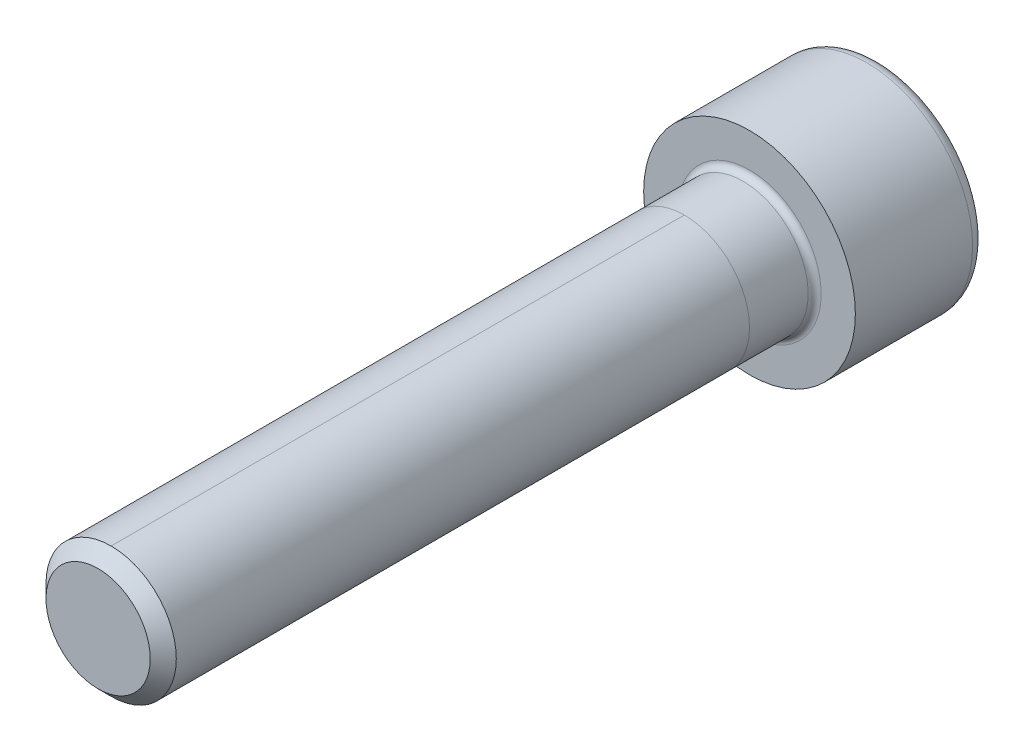
ISO-10303-21;
HEADER;
FILE_DESCRIPTION(('STEP AP214'),'2;1');
FILE_NAME('part.step','',(''),(''),'','','');
FILE_SCHEMA(('AUTOMOTIVE_DESIGN { 1 0 10303 214 1 1 1 1 }'));
ENDSEC;
DATA;
#1=APPLICATION_CONTEXT('core data for automotive mechanical design processes');
#2=APPLICATION_PROTOCOL_DEFINITION('international standard','automotive_design',2000,#1);
#3=PRODUCT_CONTEXT('',#1,'mechanical');
#4=PRODUCT('Part','Part','',(#3));
#5=PRODUCT_RELATED_PRODUCT_CATEGORY('part','',(#4));
#6=PRODUCT_DEFINITION_FORMATION('','',#4);
#7=PRODUCT_DEFINITION_CONTEXT('part definition',#1,'design');
#8=PRODUCT_DEFINITION('design','',#6,#7);
#9=PRODUCT_DEFINITION_SHAPE('','',#8);
#10=(LENGTH_UNIT() NAMED_UNIT(*) SI_UNIT(.MILLI.,.METRE.));
#11=(NAMED_UNIT(*) PLANE_ANGLE_UNIT() SI_UNIT($,.RADIAN.));
#12=(NAMED_UNIT(*) SI_UNIT($,.STERADIAN.) SOLID_ANGLE_UNIT());
#13=UNCERTAINTY_MEASURE_WITH_UNIT(LENGTH_MEASURE(1.E-05),#10,'distance_accuracy_value','');
#14=(GEOMETRIC_REPRESENTATION_CONTEXT(3) GLOBAL_UNCERTAINTY_ASSIGNED_CONTEXT((#13)) GLOBAL_UNIT_ASSIGNED_CONTEXT((#10,
#11,#12)) REPRESENTATION_CONTEXT('',''));
#15=CARTESIAN_POINT('',(0.,0.,0.));
#16=DIRECTION('',(0.,0.,1.));
#17=DIRECTION('',(1.,0.,0.));
#18=AXIS2_PLACEMENT_3D('',#15,#16,#17);
#19=CARTESIAN_POINT('',(0.,0.,40.));
#20=DIRECTION('',(0.,0.,-1.));
#21=DIRECTION('',(-1.,0.,0.));
#22=AXIS2_PLACEMENT_3D('',#19,#20,#21);
#23=CYLINDRICAL_SURFACE('',#22,4.);
#24=DIRECTION('',(0.,0.,-1.));
#25=VECTOR('',#24,1.);
#26=CARTESIAN_POINT('',(0.,4.,40.));
#27=LINE('',#26,#25);
#28=CARTESIAN_POINT('',(0.,4.,39.2));
#29=VERTEX_POINT('',#28);
#30=CARTESIAN_POINT('',(0.,4.,3.99999999999999));
#31=VERTEX_POINT('',#30);
#32=EDGE_CURVE('E58',#29,#31,#27,.T.);
#33=ORIENTED_EDGE('',*,*,#32,.F.);
#34=CARTESIAN_POINT('',(0.,0.,39.2));
#35=DIRECTION('',(0.,0.,1.));
#36=DIRECTION('',(1.,0.,0.));
#37=AXIS2_PLACEMENT_3D('',#34,#35,#36);
#38=CIRCLE('',#37,4.);
#39=CARTESIAN_POINT('',(0.,-4.,39.2));
#40=VERTEX_POINT('',#39);
#41=EDGE_CURVE('E192',#29,#40,#38,.F.);
#42=ORIENTED_EDGE('',*,*,#41,.T.);
#43=DIRECTION('',(0.,0.,-1.));
#44=VECTOR('',#43,1.);
#45=CARTESIAN_POINT('',(0.,-4.,40.));
#46=LINE('',#45,#44);
#47=CARTESIAN_POINT('',(0.,-4.,4.00000000000001));
#48=VERTEX_POINT('',#47);
#49=EDGE_CURVE('E195',#40,#48,#46,.T.);
#50=ORIENTED_EDGE('',*,*,#49,.T.);
#51=CARTESIAN_POINT('',(0.,0.,4.));
#52=DIRECTION('',(0.,0.,1.));
#53=DIRECTION('',(0.,-1.,0.));
#54=AXIS2_PLACEMENT_3D('',#51,#52,#53);
#55=CIRCLE('',#54,4.);
#56=EDGE_CURVE('E64',#48,#31,#55,.T.);
#57=ORIENTED_EDGE('',*,*,#56,.T.);
#58=EDGE_LOOP('',(#33,#42,#50,#57));
#59=FACE_BOUND('',#58,.T.);
#60=ADVANCED_FACE('F43',(#59),#23,.T.);
#61=CARTESIAN_POINT('',(0.,0.,0.399999999999998));
#62=DIRECTION('',(0.,0.,-1.));
#63=DIRECTION('',(-1.,0.,0.));
#64=AXIS2_PLACEMENT_3D('',#61,#62,#63);
#65=CIRCLE('',#64,4.);
#66=CARTESIAN_POINT('',(-4.,0.,0.399999999999998));
#67=VERTEX_POINT('',#66);
#68=EDGE_CURVE('E12',#67,#67,#65,.F.);
#69=ORIENTED_EDGE('',*,*,#68,.T.);
#70=EDGE_LOOP('',(#69));
#71=FACE_BOUND('',#70,.T.);
#72=ORIENTED_EDGE('',*,*,#56,.F.);
#73=EDGE_CURVE('E217',#31,#48,#55,.T.);
#74=ORIENTED_EDGE('',*,*,#73,.F.);
#75=EDGE_LOOP('',(#72,#74));
#76=FACE_BOUND('',#75,.T.);
#77=ADVANCED_FACE('F235',(#71,#76),#23,.T.);
#78=EDGE_CURVE('E193',#40,#29,#38,.F.);
#79=ORIENTED_EDGE('',*,*,#78,.T.);
#80=ORIENTED_EDGE('',*,*,#32,.T.);
#81=ORIENTED_EDGE('',*,*,#73,.T.);
#82=ORIENTED_EDGE('',*,*,#49,.F.);
#83=EDGE_LOOP('',(#79,#80,#81,#82));
#84=FACE_BOUND('',#83,.T.);
#85=ADVANCED_FACE('F238',(#84),#23,.T.);
#86=CARTESIAN_POINT('',(0.,0.,40.));
#87=DIRECTION('',(0.,0.,1.));
#88=DIRECTION('',(1.,0.,0.));
#89=AXIS2_PLACEMENT_3D('',#86,#87,#88);
#90=PLANE('',#89);
#91=CARTESIAN_POINT('',(0.,0.,40.));
#92=DIRECTION('',(0.,0.,1.));
#93=DIRECTION('',(1.,0.,0.));
#94=AXIS2_PLACEMENT_3D('',#91,#92,#93);
#95=CIRCLE('',#94,3.20000000000001);
#96=CARTESIAN_POINT('',(3.20000000000001,0.,40.));
#97=VERTEX_POINT('',#96);
#98=EDGE_CURVE('E189',#97,#97,#95,.T.);
#99=ORIENTED_EDGE('',*,*,#98,.T.);
#100=EDGE_LOOP('',(#99));
#101=FACE_BOUND('',#100,.T.);
#102=ADVANCED_FACE('F246',(#101),#90,.T.);
#103=CARTESIAN_POINT('',(0.,0.,0.));
#104=DIRECTION('',(0.,0.,-1.));
#105=DIRECTION('',(-1.,0.,0.));
#106=AXIS2_PLACEMENT_3D('',#103,#104,#105);
#107=PLANE('',#106);
#108=CARTESIAN_POINT('',(0.,0.,0.));
#109=DIRECTION('',(0.,0.,-1.));
#110=DIRECTION('',(-1.,0.,0.));
#111=AXIS2_PLACEMENT_3D('',#108,#109,#110);
#112=CIRCLE('',#111,4.4);
#113=CARTESIAN_POINT('',(-4.4,0.,0.));
#114=VERTEX_POINT('',#113);
#115=EDGE_CURVE('E51',#114,#114,#112,.T.);
#116=ORIENTED_EDGE('',*,*,#115,.T.);
#117=EDGE_LOOP('',(#116));
#118=FACE_BOUND('',#117,.T.);
#119=CARTESIAN_POINT('',(0.,0.,0.));
#120=DIRECTION('',(0.,0.,-1.));
#121=DIRECTION('',(-1.,0.,0.));
#122=AXIS2_PLACEMENT_3D('',#119,#120,#121);
#123=CIRCLE('',#122,6.5);
#124=CARTESIAN_POINT('',(-6.5,0.,0.));
#125=VERTEX_POINT('',#124);
#126=EDGE_CURVE('E179',#125,#125,#123,.T.);
#127=ORIENTED_EDGE('',*,*,#126,.F.);
#128=EDGE_LOOP('',(#127));
#129=FACE_BOUND('',#128,.T.);
#130=ADVANCED_FACE('F224',(#118,#129),#107,.F.);
#131=CARTESIAN_POINT('',(0.,0.,-8.));
#132=DIRECTION('',(0.,0.,1.));
#133=DIRECTION('',(1.,0.,0.));
#134=AXIS2_PLACEMENT_3D('',#131,#132,#133);
#135=CYLINDRICAL_SURFACE('',#134,6.5);
#136=CARTESIAN_POINT('',(0.,0.,-7.2));
#137=DIRECTION('',(0.,0.,-1.));
#138=DIRECTION('',(-1.,0.,0.));
#139=AXIS2_PLACEMENT_3D('',#136,#137,#138);
#140=CIRCLE('',#139,6.5);
#141=CARTESIAN_POINT('',(-6.5,0.,-7.2));
#142=VERTEX_POINT('',#141);
#143=EDGE_CURVE('E186',#142,#142,#140,.F.);
#144=ORIENTED_EDGE('',*,*,#143,.T.);
#145=EDGE_LOOP('',(#144));
#146=FACE_BOUND('',#145,.T.);
#147=ORIENTED_EDGE('',*,*,#126,.T.);
#148=EDGE_LOOP('',(#147));
#149=FACE_BOUND('',#148,.T.);
#150=ADVANCED_FACE('F282',(#146,#149),#135,.T.);
#151=CARTESIAN_POINT('',(0.,0.,-8.));
#152=DIRECTION('',(0.,0.,-1.));
#153=DIRECTION('',(-1.,0.,0.));
#154=AXIS2_PLACEMENT_3D('',#151,#152,#153);
#155=PLANE('',#154);
#156=DIRECTION('',(0.5,-0.866025403784439,0.));
#157=VECTOR('',#156,1.);
#158=CARTESIAN_POINT('',(1.73205080756888,3.,-8.));
#159=LINE('',#158,#157);
#160=CARTESIAN_POINT('',(1.73205080756888,3.,-8.));
#161=VERTEX_POINT('',#160);
#162=CARTESIAN_POINT('',(3.46410161513775,0.,-8.));
#163=VERTEX_POINT('',#162);
#164=EDGE_CURVE('E122',#161,#163,#159,.T.);
#165=ORIENTED_EDGE('',*,*,#164,.F.);
#166=DIRECTION('',(1.,0.,0.));
#167=VECTOR('',#166,1.);
#168=CARTESIAN_POINT('',(-1.73205080756888,3.,-8.));
#169=LINE('',#168,#167);
#170=CARTESIAN_POINT('',(-1.73205080756888,3.,-8.));
#171=VERTEX_POINT('',#170);
#172=EDGE_CURVE('E176',#171,#161,#169,.T.);
#173=ORIENTED_EDGE('',*,*,#172,.F.);
#174=DIRECTION('',(0.5,0.866025403784439,0.));
#175=VECTOR('',#174,1.);
#176=CARTESIAN_POINT('',(-3.46410161513775,0.,-8.));
#177=LINE('',#176,#175);
#178=CARTESIAN_POINT('',(-3.46410161513775,0.,-8.));
#179=VERTEX_POINT('',#178);
#180=EDGE_CURVE('E173',#179,#171,#177,.T.);
#181=ORIENTED_EDGE('',*,*,#180,.F.);
#182=DIRECTION('',(-0.5,0.866025403784439,0.));
#183=VECTOR('',#182,1.);
#184=CARTESIAN_POINT('',(-1.73205080756888,-3.,-8.));
#185=LINE('',#184,#183);
#186=CARTESIAN_POINT('',(-1.73205080756888,-3.,-8.));
#187=VERTEX_POINT('',#186);
#188=EDGE_CURVE('E170',#187,#179,#185,.T.);
#189=ORIENTED_EDGE('',*,*,#188,.F.);
#190=DIRECTION('',(-1.,0.,0.));
#191=VECTOR('',#190,1.);
#192=CARTESIAN_POINT('',(1.73205080756888,-3.,-8.));
#193=LINE('',#192,#191);
#194=CARTESIAN_POINT('',(1.73205080756888,-3.,-8.));
#195=VERTEX_POINT('',#194);
#196=EDGE_CURVE('E167',#195,#187,#193,.T.);
#197=ORIENTED_EDGE('',*,*,#196,.F.);
#198=DIRECTION('',(-0.5,-0.866025403784439,0.));
#199=VECTOR('',#198,1.);
#200=CARTESIAN_POINT('',(3.46410161513775,0.,-8.));
#201=LINE('',#200,#199);
#202=EDGE_CURVE('E164',#163,#195,#201,.T.);
#203=ORIENTED_EDGE('',*,*,#202,.F.);
#204=EDGE_LOOP('',(#165,#173,#181,#189,#197,#203));
#205=FACE_BOUND('',#204,.T.);
#206=CARTESIAN_POINT('',(0.,0.,-8.));
#207=DIRECTION('',(0.,0.,-1.));
#208=DIRECTION('',(-1.,0.,0.));
#209=AXIS2_PLACEMENT_3D('',#206,#207,#208);
#210=CIRCLE('',#209,5.7);
#211=CARTESIAN_POINT('',(-5.7,0.,-8.));
#212=VERTEX_POINT('',#211);
#213=EDGE_CURVE('E182',#212,#212,#210,.T.);
#214=ORIENTED_EDGE('',*,*,#213,.T.);
#215=EDGE_LOOP('',(#214));
#216=FACE_BOUND('',#215,.T.);
#217=ADVANCED_FACE('F277',(#205,#216),#155,.T.);
#218=CARTESIAN_POINT('',(0.,0.,-7.2));
#219=DIRECTION('',(0.,0.,-1.));
#220=DIRECTION('',(-1.,0.,0.));
#221=AXIS2_PLACEMENT_3D('',#218,#219,#220);
#222=TOROIDAL_SURFACE('',#221,5.7,0.8);
#223=ORIENTED_EDGE('',*,*,#143,.F.);
#224=EDGE_LOOP('',(#223));
#225=FACE_BOUND('',#224,.T.);
#226=ORIENTED_EDGE('',*,*,#213,.F.);
#227=EDGE_LOOP('',(#226));
#228=FACE_BOUND('',#227,.T.);
#229=ADVANCED_FACE('F268',(#225,#228),#222,.T.);
#230=CARTESIAN_POINT('',(0.,0.,40.));
#231=DIRECTION('',(0.,0.,-1.));
#232=DIRECTION('',(-1.,0.,0.));
#233=AXIS2_PLACEMENT_3D('',#230,#231,#232);
#234=CONICAL_SURFACE('',#233,3.20000000000001,0.785398163397446);
#235=ORIENTED_EDGE('',*,*,#78,.F.);
#236=ORIENTED_EDGE('',*,*,#41,.F.);
#237=EDGE_LOOP('',(#235,#236));
#238=FACE_BOUND('',#237,.T.);
#239=ORIENTED_EDGE('',*,*,#98,.F.);
#240=EDGE_LOOP('',(#239));
#241=FACE_BOUND('',#240,.T.);
#242=ADVANCED_FACE('F255',(#238,#241),#234,.T.);
#243=CARTESIAN_POINT('',(1.73205080756888,3.,-5.33333333333333));
#244=DIRECTION('',(0.866025403784439,0.5,0.));
#245=DIRECTION('',(-0.5,0.866025403784439,0.));
#246=AXIS2_PLACEMENT_3D('',#243,#244,#245);
#247=PLANE('',#246);
#248=ORIENTED_EDGE('',*,*,#164,.T.);
#249=DIRECTION('',(0.,0.,-1.));
#250=VECTOR('',#249,1.);
#251=CARTESIAN_POINT('',(3.46410161513775,0.,-5.33333333333333));
#252=LINE('',#251,#250);
#253=CARTESIAN_POINT('',(3.46410161513776,0.,-5.33333333333333));
#254=VERTEX_POINT('',#253);
#255=EDGE_CURVE('E200',#254,#163,#252,.T.);
#256=ORIENTED_EDGE('',*,*,#255,.F.);
#257=DIRECTION('',(-0.5,0.866025403784439,0.));
#258=VECTOR('',#257,1.);
#259=CARTESIAN_POINT('',(3.46410161513775,0.,-5.33333333333333));
#260=LINE('',#259,#258);
#261=CARTESIAN_POINT('',(1.73205080756888,3.,-5.33333333333333));
#262=VERTEX_POINT('',#261);
#263=EDGE_CURVE('E117',#262,#254,#260,.F.);
#264=ORIENTED_EDGE('',*,*,#263,.F.);
#265=DIRECTION('',(0.,0.,-1.));
#266=VECTOR('',#265,1.);
#267=CARTESIAN_POINT('',(1.73205080756888,3.,-5.33333333333333));
#268=LINE('',#267,#266);
#269=EDGE_CURVE('E183',#262,#161,#268,.T.);
#270=ORIENTED_EDGE('',*,*,#269,.T.);
#271=EDGE_LOOP('',(#248,#256,#264,#270));
#272=FACE_BOUND('',#271,.T.);
#273=ADVANCED_FACE('F267',(#272),#247,.F.);
#274=CARTESIAN_POINT('',(-1.73205080756888,3.,-5.33333333333333));
#275=DIRECTION('',(0.,1.,0.));
#276=DIRECTION('',(-1.,0.,0.));
#277=AXIS2_PLACEMENT_3D('',#274,#275,#276);
#278=PLANE('',#277);
#279=ORIENTED_EDGE('',*,*,#172,.T.);
#280=ORIENTED_EDGE('',*,*,#269,.F.);
#281=DIRECTION('',(1.,0.,0.));
#282=VECTOR('',#281,1.);
#283=CARTESIAN_POINT('',(0.,3.,-5.33333333333333));
#284=LINE('',#283,#282);
#285=CARTESIAN_POINT('',(-1.73205080756888,3.,-5.33333333333333));
#286=VERTEX_POINT('',#285);
#287=EDGE_CURVE('E131',#286,#262,#284,.T.);
#288=ORIENTED_EDGE('',*,*,#287,.F.);
#289=DIRECTION('',(0.,0.,-1.));
#290=VECTOR('',#289,1.);
#291=CARTESIAN_POINT('',(-1.73205080756888,3.,-5.33333333333333));
#292=LINE('',#291,#290);
#293=EDGE_CURVE('E196',#286,#171,#292,.T.);
#294=ORIENTED_EDGE('',*,*,#293,.T.);
#295=EDGE_LOOP('',(#279,#280,#288,#294));
#296=FACE_BOUND('',#295,.T.);
#297=ADVANCED_FACE('F274',(#296),#278,.F.);
#298=CARTESIAN_POINT('',(-3.46410161513775,0.,-5.33333333333333));
#299=DIRECTION('',(-0.866025403784439,0.5,0.));
#300=DIRECTION('',(-0.5,-0.866025403784439,0.));
#301=AXIS2_PLACEMENT_3D('',#298,#299,#300);
#302=PLANE('',#301);
#303=ORIENTED_EDGE('',*,*,#180,.T.);
#304=ORIENTED_EDGE('',*,*,#293,.F.);
#305=DIRECTION('',(-0.5,-0.866025403784439,0.));
#306=VECTOR('',#305,1.);
#307=CARTESIAN_POINT('',(-1.73205080756888,3.,-5.33333333333333));
#308=LINE('',#307,#306);
#309=CARTESIAN_POINT('',(-3.46410161513775,0.,-5.33333333333333));
#310=VERTEX_POINT('',#309);
#311=EDGE_CURVE('E139',#310,#286,#308,.F.);
#312=ORIENTED_EDGE('',*,*,#311,.F.);
#313=DIRECTION('',(0.,0.,-1.));
#314=VECTOR('',#313,1.);
#315=CARTESIAN_POINT('',(-3.46410161513775,0.,-5.33333333333333));
#316=LINE('',#315,#314);
#317=EDGE_CURVE('E198',#310,#179,#316,.T.);
#318=ORIENTED_EDGE('',*,*,#317,.T.);
#319=EDGE_LOOP('',(#303,#304,#312,#318));
#320=FACE_BOUND('',#319,.T.);
#321=ADVANCED_FACE('F310',(#320),#302,.F.);
#322=CARTESIAN_POINT('',(-1.73205080756888,-3.,-5.33333333333333));
#323=DIRECTION('',(-0.866025403784439,-0.5,0.));
#324=DIRECTION('',(0.5,-0.866025403784439,0.));
#325=AXIS2_PLACEMENT_3D('',#322,#323,#324);
#326=PLANE('',#325);
#327=ORIENTED_EDGE('',*,*,#188,.T.);
#328=ORIENTED_EDGE('',*,*,#317,.F.);
#329=DIRECTION('',(0.5,-0.866025403784439,0.));
#330=VECTOR('',#329,1.);
#331=CARTESIAN_POINT('',(-3.46410161513776,0.,-5.33333333333333));
#332=LINE('',#331,#330);
#333=CARTESIAN_POINT('',(-1.73205080756888,-3.,-5.33333333333333));
#334=VERTEX_POINT('',#333);
#335=EDGE_CURVE('E147',#334,#310,#332,.F.);
#336=ORIENTED_EDGE('',*,*,#335,.F.);
#337=DIRECTION('',(0.,0.,-1.));
#338=VECTOR('',#337,1.);
#339=CARTESIAN_POINT('',(-1.73205080756888,-3.,-5.33333333333333));
#340=LINE('',#339,#338);
#341=EDGE_CURVE('E205',#334,#187,#340,.T.);
#342=ORIENTED_EDGE('',*,*,#341,.T.);
#343=EDGE_LOOP('',(#327,#328,#336,#342));
#344=FACE_BOUND('',#343,.T.);
#345=ADVANCED_FACE('F306',(#344),#326,.F.);
#346=CARTESIAN_POINT('',(1.73205080756888,-3.,-5.33333333333333));
#347=DIRECTION('',(0.,-1.,0.));
#348=DIRECTION('',(1.,0.,0.));
#349=AXIS2_PLACEMENT_3D('',#346,#347,#348);
#350=PLANE('',#349);
#351=ORIENTED_EDGE('',*,*,#196,.T.);
#352=ORIENTED_EDGE('',*,*,#341,.F.);
#353=DIRECTION('',(1.,0.,0.));
#354=VECTOR('',#353,1.);
#355=CARTESIAN_POINT('',(0.,-3.,-5.33333333333333));
#356=LINE('',#355,#354);
#357=CARTESIAN_POINT('',(1.73205080756888,-3.,-5.33333333333333));
#358=VERTEX_POINT('',#357);
#359=EDGE_CURVE('E154',#358,#334,#356,.F.);
#360=ORIENTED_EDGE('',*,*,#359,.F.);
#361=DIRECTION('',(0.,0.,-1.));
#362=VECTOR('',#361,1.);
#363=CARTESIAN_POINT('',(1.73205080756888,-3.,-5.33333333333333));
#364=LINE('',#363,#362);
#365=EDGE_CURVE('E203',#358,#195,#364,.T.);
#366=ORIENTED_EDGE('',*,*,#365,.T.);
#367=EDGE_LOOP('',(#351,#352,#360,#366));
#368=FACE_BOUND('',#367,.T.);
#369=ADVANCED_FACE('F302',(#368),#350,.F.);
#370=CARTESIAN_POINT('',(3.46410161513775,0.,-5.33333333333333));
#371=DIRECTION('',(0.866025403784439,-0.5,0.));
#372=DIRECTION('',(0.5,0.866025403784439,0.));
#373=AXIS2_PLACEMENT_3D('',#370,#371,#372);
#374=PLANE('',#373);
#375=ORIENTED_EDGE('',*,*,#202,.T.);
#376=ORIENTED_EDGE('',*,*,#365,.F.);
#377=DIRECTION('',(0.5,0.866025403784439,0.));
#378=VECTOR('',#377,1.);
#379=CARTESIAN_POINT('',(1.73205080756888,-3.,-5.33333333333333));
#380=LINE('',#379,#378);
#381=EDGE_CURVE('E159',#254,#358,#380,.F.);
#382=ORIENTED_EDGE('',*,*,#381,.F.);
#383=ORIENTED_EDGE('',*,*,#255,.T.);
#384=EDGE_LOOP('',(#375,#376,#382,#383));
#385=FACE_BOUND('',#384,.T.);
#386=ADVANCED_FACE('F299',(#385),#374,.F.);
#387=CARTESIAN_POINT('',(-1.16634372662244,-0.6733888645331,-3.78781236299868));
#388=DIRECTION('',(0.290126882702444,0.167504833827403,0.942214690279141));
#389=DIRECTION('',(0.955717783517744,0.,-0.294284757111084));
#390=AXIS2_PLACEMENT_3D('',#387,#388,#389);
#391=PLANE('',#390);
#392=DIRECTION('',(-0.477858891758872,-0.827675879374923,0.294284757111084));
#393=VECTOR('',#392,1.);
#394=CARTESIAN_POINT('',(1.73205080756888,3.,-5.33333333333333));
#395=LINE('',#394,#393);
#396=CARTESIAN_POINT('',(0.,0.,-4.26666666666667));
#397=VERTEX_POINT('',#396);
#398=EDGE_CURVE('E114',#262,#397,#395,.T.);
#399=ORIENTED_EDGE('',*,*,#398,.F.);
#400=ORIENTED_EDGE('',*,*,#263,.T.);
#401=DIRECTION('',(-0.955717783517745,0.,0.294284757111084));
#402=VECTOR('',#401,1.);
#403=CARTESIAN_POINT('',(3.46410161513775,0.,-5.33333333333333));
#404=LINE('',#403,#402);
#405=EDGE_CURVE('E111',#254,#397,#404,.T.);
#406=ORIENTED_EDGE('',*,*,#405,.T.);
#407=EDGE_LOOP('',(#399,#400,#406));
#408=FACE_BOUND('',#407,.T.);
#409=ADVANCED_FACE('F113',(#408),#391,.F.);
#410=CARTESIAN_POINT('',(-1.16634372662245,0.6733888645331,-3.78781236299869));
#411=DIRECTION('',(0.290126882702444,-0.167504833827403,0.942214690279141));
#412=DIRECTION('',(0.955717783517745,0.,-0.294284757111084));
#413=AXIS2_PLACEMENT_3D('',#410,#411,#412);
#414=PLANE('',#413);
#415=ORIENTED_EDGE('',*,*,#405,.F.);
#416=ORIENTED_EDGE('',*,*,#381,.T.);
#417=DIRECTION('',(-0.477858891758872,0.827675879374923,0.294284757111084));
#418=VECTOR('',#417,1.);
#419=CARTESIAN_POINT('',(1.73205080756888,-3.,-5.33333333333333));
#420=LINE('',#419,#418);
#421=EDGE_CURVE('E152',#358,#397,#420,.T.);
#422=ORIENTED_EDGE('',*,*,#421,.T.);
#423=EDGE_LOOP('',(#415,#416,#422));
#424=FACE_BOUND('',#423,.T.);
#425=ADVANCED_FACE('F157',(#424),#414,.F.);
#426=CARTESIAN_POINT('',(0.,-1.3467777290662,-3.78781236299868));
#427=DIRECTION('',(0.,0.335009667654806,0.942214690279141));
#428=DIRECTION('',(0.,-0.942214690279141,0.335009667654806));
#429=AXIS2_PLACEMENT_3D('',#426,#427,#428);
#430=PLANE('',#429);
#431=DIRECTION('',(0.477858891758872,-0.827675879374923,0.294284757111084));
#432=VECTOR('',#431,1.);
#433=CARTESIAN_POINT('',(-1.73205080756888,3.,-5.33333333333333));
#434=LINE('',#433,#432);
#435=EDGE_CURVE('E128',#286,#397,#434,.T.);
#436=ORIENTED_EDGE('',*,*,#435,.F.);
#437=ORIENTED_EDGE('',*,*,#287,.T.);
#438=ORIENTED_EDGE('',*,*,#398,.T.);
#439=EDGE_LOOP('',(#436,#437,#438));
#440=FACE_BOUND('',#439,.T.);
#441=ADVANCED_FACE('F127',(#440),#430,.F.);
#442=CARTESIAN_POINT('',(1.16634372662245,-0.6733888645331,-3.78781236299868));
#443=DIRECTION('',(-0.290126882702444,0.167504833827403,0.942214690279141));
#444=DIRECTION('',(0.955717783517744,0.,0.294284757111084));
#445=AXIS2_PLACEMENT_3D('',#442,#443,#444);
#446=PLANE('',#445);
#447=DIRECTION('',(0.955717783517745,0.,0.294284757111084));
#448=VECTOR('',#447,1.);
#449=CARTESIAN_POINT('',(-3.46410161513775,0.,-5.33333333333333));
#450=LINE('',#449,#448);
#451=EDGE_CURVE('E136',#310,#397,#450,.T.);
#452=ORIENTED_EDGE('',*,*,#451,.F.);
#453=ORIENTED_EDGE('',*,*,#311,.T.);
#454=ORIENTED_EDGE('',*,*,#435,.T.);
#455=EDGE_LOOP('',(#452,#453,#454));
#456=FACE_BOUND('',#455,.T.);
#457=ADVANCED_FACE('F135',(#456),#446,.F.);
#458=CARTESIAN_POINT('',(1.16634372662245,0.6733888645331,-3.78781236299868));
#459=DIRECTION('',(-0.290126882702444,-0.167504833827403,0.942214690279141));
#460=DIRECTION('',(0.955717783517744,0.,0.294284757111084));
#461=AXIS2_PLACEMENT_3D('',#458,#459,#460);
#462=PLANE('',#461);
#463=DIRECTION('',(0.477858891758872,0.827675879374923,0.294284757111084));
#464=VECTOR('',#463,1.);
#465=CARTESIAN_POINT('',(-1.73205080756888,-3.,-5.33333333333333));
#466=LINE('',#465,#464);
#467=EDGE_CURVE('E144',#334,#397,#466,.T.);
#468=ORIENTED_EDGE('',*,*,#467,.F.);
#469=ORIENTED_EDGE('',*,*,#335,.T.);
#470=ORIENTED_EDGE('',*,*,#451,.T.);
#471=EDGE_LOOP('',(#468,#469,#470));
#472=FACE_BOUND('',#471,.T.);
#473=ADVANCED_FACE('F143',(#472),#462,.F.);
#474=CARTESIAN_POINT('',(0.,1.3467777290662,-3.78781236299868));
#475=DIRECTION('',(0.,-0.335009667654806,0.942214690279141));
#476=DIRECTION('',(0.,-0.942214690279141,-0.335009667654806));
#477=AXIS2_PLACEMENT_3D('',#474,#475,#476);
#478=PLANE('',#477);
#479=ORIENTED_EDGE('',*,*,#421,.F.);
#480=ORIENTED_EDGE('',*,*,#359,.T.);
#481=ORIENTED_EDGE('',*,*,#467,.T.);
#482=EDGE_LOOP('',(#479,#480,#481));
#483=FACE_BOUND('',#482,.T.);
#484=ADVANCED_FACE('F151',(#483),#478,.F.);
#485=CARTESIAN_POINT('',(0.,0.,0.399999999999998));
#486=DIRECTION('',(0.,0.,-1.));
#487=DIRECTION('',(-1.,0.,0.));
#488=AXIS2_PLACEMENT_3D('',#485,#486,#487);
#489=TOROIDAL_SURFACE('',#488,4.4,0.4);
#490=ORIENTED_EDGE('',*,*,#68,.F.);
#491=EDGE_LOOP('',(#490));
#492=FACE_BOUND('',#491,.T.);
#493=ORIENTED_EDGE('',*,*,#115,.F.);
#494=EDGE_LOOP('',(#493));
#495=FACE_BOUND('',#494,.T.);
#496=ADVANCED_FACE('F45',(#492,#495),#489,.F.);
#497=CLOSED_SHELL('',(#60,#77,#85,#102,#130,#150,#217,#229,#242,#273,#297,#321,#345,#369,#386,
#409,#425,#441,#457,#473,#484,#496));
#498=MANIFOLD_SOLID_BREP('B2',#497);
#499=ADVANCED_BREP_SHAPE_REPRESENTATION('',(#18,#498),#14);
#500=SHAPE_DEFINITION_REPRESENTATION(#9,#499);
ENDSEC;
END-ISO-10303-21;
